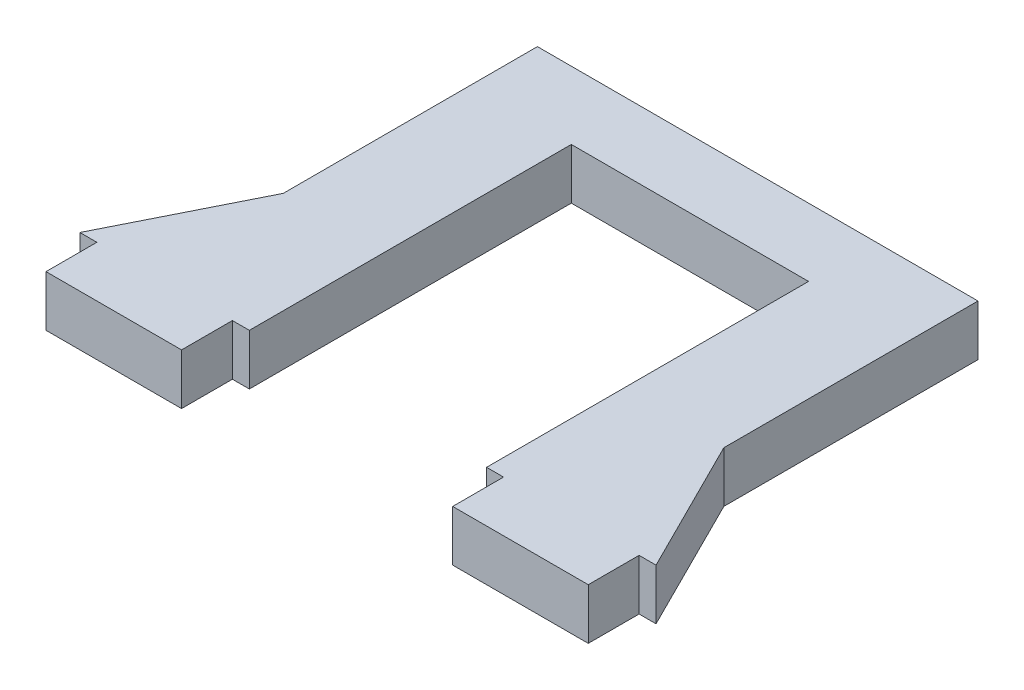
ISO-10303-21;
HEADER;
FILE_DESCRIPTION(('STEP AP214'),'2;1');
FILE_NAME('part.step','',(''),(''),'','','');
FILE_SCHEMA(('AUTOMOTIVE_DESIGN { 1 0 10303 214 1 1 1 1 }'));
ENDSEC;
DATA;
#1=APPLICATION_CONTEXT('core data for automotive mechanical design processes');
#2=APPLICATION_PROTOCOL_DEFINITION('international standard','automotive_design',2000,#1);
#3=PRODUCT_CONTEXT('',#1,'mechanical');
#4=PRODUCT('Part','Part','',(#3));
#5=PRODUCT_RELATED_PRODUCT_CATEGORY('part','',(#4));
#6=PRODUCT_DEFINITION_FORMATION('','',#4);
#7=PRODUCT_DEFINITION_CONTEXT('part definition',#1,'design');
#8=PRODUCT_DEFINITION('design','',#6,#7);
#9=PRODUCT_DEFINITION_SHAPE('','',#8);
#10=(LENGTH_UNIT() NAMED_UNIT(*) SI_UNIT(.MILLI.,.METRE.));
#11=(NAMED_UNIT(*) PLANE_ANGLE_UNIT() SI_UNIT($,.RADIAN.));
#12=(NAMED_UNIT(*) SI_UNIT($,.STERADIAN.) SOLID_ANGLE_UNIT());
#13=UNCERTAINTY_MEASURE_WITH_UNIT(LENGTH_MEASURE(1.E-05),#10,'distance_accuracy_value','');
#14=(GEOMETRIC_REPRESENTATION_CONTEXT(3) GLOBAL_UNCERTAINTY_ASSIGNED_CONTEXT((#13)) GLOBAL_UNIT_ASSIGNED_CONTEXT((#10,
#11,#12)) REPRESENTATION_CONTEXT('',''));
#15=CARTESIAN_POINT('',(0.,0.,0.));
#16=DIRECTION('',(0.,0.,1.));
#17=DIRECTION('',(1.,0.,0.));
#18=AXIS2_PLACEMENT_3D('',#15,#16,#17);
#19=CARTESIAN_POINT('',(7.,1.5,9.5));
#20=DIRECTION('',(0.,0.,-1.));
#21=DIRECTION('',(-1.,0.,0.));
#22=AXIS2_PLACEMENT_3D('',#19,#20,#21);
#23=PLANE('',#22);
#24=DIRECTION('',(0.,-1.,0.));
#25=VECTOR('',#24,1.);
#26=CARTESIAN_POINT('',(8.,1.5,9.5));
#27=LINE('',#26,#25);
#28=CARTESIAN_POINT('',(8.,1.5,9.5));
#29=VERTEX_POINT('',#28);
#30=CARTESIAN_POINT('',(8.,-1.5,9.5));
#31=VERTEX_POINT('',#30);
#32=EDGE_CURVE('E58',#29,#31,#27,.T.);
#33=ORIENTED_EDGE('',*,*,#32,.F.);
#34=DIRECTION('',(1.,0.,0.));
#35=VECTOR('',#34,1.);
#36=CARTESIAN_POINT('',(7.,1.5,9.5));
#37=LINE('',#36,#35);
#38=CARTESIAN_POINT('',(7.,1.5,9.5));
#39=VERTEX_POINT('',#38);
#40=EDGE_CURVE('E168',#39,#29,#37,.T.);
#41=ORIENTED_EDGE('',*,*,#40,.F.);
#42=DIRECTION('',(0.,-1.,0.));
#43=VECTOR('',#42,1.);
#44=CARTESIAN_POINT('',(7.,1.5,9.5));
#45=LINE('',#44,#43);
#46=CARTESIAN_POINT('',(7.,-1.5,9.5));
#47=VERTEX_POINT('',#46);
#48=EDGE_CURVE('E293',#39,#47,#45,.T.);
#49=ORIENTED_EDGE('',*,*,#48,.T.);
#50=DIRECTION('',(1.,0.,0.));
#51=VECTOR('',#50,1.);
#52=CARTESIAN_POINT('',(7.,-1.5,9.5));
#53=LINE('',#52,#51);
#54=EDGE_CURVE('E275',#47,#31,#53,.T.);
#55=ORIENTED_EDGE('',*,*,#54,.T.);
#56=EDGE_LOOP('',(#33,#41,#49,#55));
#57=FACE_BOUND('',#56,.T.);
#58=ADVANCED_FACE('F35',(#57),#23,.F.);
#59=DIRECTION('',(0.,-1.,0.));
#60=VECTOR('',#59,1.);
#61=CARTESIAN_POINT('',(16.,1.5,9.5));
#62=LINE('',#61,#60);
#63=CARTESIAN_POINT('',(16.,1.5,9.5));
#64=VERTEX_POINT('',#63);
#65=CARTESIAN_POINT('',(16.,-1.5,9.5));
#66=VERTEX_POINT('',#65);
#67=EDGE_CURVE('E186',#64,#66,#62,.T.);
#68=ORIENTED_EDGE('',*,*,#67,.T.);
#69=CARTESIAN_POINT('',(17.,-1.5,9.5));
#70=VERTEX_POINT('',#69);
#71=EDGE_CURVE('E274',#66,#70,#53,.T.);
#72=ORIENTED_EDGE('',*,*,#71,.T.);
#73=DIRECTION('',(0.,-1.,0.));
#74=VECTOR('',#73,1.);
#75=CARTESIAN_POINT('',(17.,1.5,9.5));
#76=LINE('',#75,#74);
#77=CARTESIAN_POINT('',(17.,1.5,9.5));
#78=VERTEX_POINT('',#77);
#79=EDGE_CURVE('E232',#78,#70,#76,.T.);
#80=ORIENTED_EDGE('',*,*,#79,.F.);
#81=EDGE_CURVE('E50',#64,#78,#37,.T.);
#82=ORIENTED_EDGE('',*,*,#81,.F.);
#83=EDGE_LOOP('',(#68,#72,#80,#82));
#84=FACE_BOUND('',#83,.T.);
#85=ADVANCED_FACE('F308',(#84),#23,.F.);
#86=CARTESIAN_POINT('',(-13.,1.5,9.5));
#87=DIRECTION('',(0.,0.,-1.));
#88=DIRECTION('',(-1.,0.,0.));
#89=AXIS2_PLACEMENT_3D('',#86,#87,#88);
#90=PLANE('',#89);
#91=DIRECTION('',(0.,-1.,0.));
#92=VECTOR('',#91,1.);
#93=CARTESIAN_POINT('',(-16.,1.5,9.5));
#94=LINE('',#93,#92);
#95=CARTESIAN_POINT('',(-16.,1.5,9.5));
#96=VERTEX_POINT('',#95);
#97=CARTESIAN_POINT('',(-16.,-1.5,9.5));
#98=VERTEX_POINT('',#97);
#99=EDGE_CURVE('E207',#96,#98,#94,.T.);
#100=ORIENTED_EDGE('',*,*,#99,.F.);
#101=DIRECTION('',(1.,0.,0.));
#102=VECTOR('',#101,1.);
#103=CARTESIAN_POINT('',(-13.,1.5,9.5));
#104=LINE('',#103,#102);
#105=CARTESIAN_POINT('',(-17.,1.5,9.5));
#106=VERTEX_POINT('',#105);
#107=EDGE_CURVE('E264',#106,#96,#104,.T.);
#108=ORIENTED_EDGE('',*,*,#107,.F.);
#109=DIRECTION('',(0.,-1.,0.));
#110=VECTOR('',#109,1.);
#111=CARTESIAN_POINT('',(-17.,1.5,9.5));
#112=LINE('',#111,#110);
#113=CARTESIAN_POINT('',(-17.,-1.5,9.5));
#114=VERTEX_POINT('',#113);
#115=EDGE_CURVE('E239',#106,#114,#112,.T.);
#116=ORIENTED_EDGE('',*,*,#115,.T.);
#117=DIRECTION('',(1.,0.,0.));
#118=VECTOR('',#117,1.);
#119=CARTESIAN_POINT('',(-13.,-1.5,9.5));
#120=LINE('',#119,#118);
#121=EDGE_CURVE('E251',#114,#98,#120,.T.);
#122=ORIENTED_EDGE('',*,*,#121,.T.);
#123=EDGE_LOOP('',(#100,#108,#116,#122));
#124=FACE_BOUND('',#123,.T.);
#125=ADVANCED_FACE('F313',(#124),#90,.F.);
#126=DIRECTION('',(0.,-1.,0.));
#127=VECTOR('',#126,1.);
#128=CARTESIAN_POINT('',(-8.,1.5,9.5));
#129=LINE('',#128,#127);
#130=CARTESIAN_POINT('',(-8.,1.5,9.5));
#131=VERTEX_POINT('',#130);
#132=CARTESIAN_POINT('',(-8.,-1.5,9.5));
#133=VERTEX_POINT('',#132);
#134=EDGE_CURVE('E216',#131,#133,#129,.T.);
#135=ORIENTED_EDGE('',*,*,#134,.T.);
#136=CARTESIAN_POINT('',(-7.,-1.5,9.5));
#137=VERTEX_POINT('',#136);
#138=EDGE_CURVE('E283',#133,#137,#120,.T.);
#139=ORIENTED_EDGE('',*,*,#138,.T.);
#140=DIRECTION('',(0.,-1.,0.));
#141=VECTOR('',#140,1.);
#142=CARTESIAN_POINT('',(-7.,1.5,9.5));
#143=LINE('',#142,#141);
#144=CARTESIAN_POINT('',(-7.,1.5,9.5));
#145=VERTEX_POINT('',#144);
#146=EDGE_CURVE('E267',#145,#137,#143,.T.);
#147=ORIENTED_EDGE('',*,*,#146,.F.);
#148=EDGE_CURVE('E263',#131,#145,#104,.T.);
#149=ORIENTED_EDGE('',*,*,#148,.F.);
#150=EDGE_LOOP('',(#135,#139,#147,#149));
#151=FACE_BOUND('',#150,.T.);
#152=ADVANCED_FACE('F332',(#151),#90,.F.);
#153=CARTESIAN_POINT('',(-13.,1.5,9.5));
#154=DIRECTION('',(1.,0.,0.));
#155=DIRECTION('',(0.,0.,-1.));
#156=AXIS2_PLACEMENT_3D('',#153,#154,#155);
#157=PLANE('',#156);
#158=DIRECTION('',(0.,-1.,0.));
#159=VECTOR('',#158,1.);
#160=CARTESIAN_POINT('',(-13.,1.5,1.5));
#161=LINE('',#160,#159);
#162=CARTESIAN_POINT('',(-13.,1.5,1.5));
#163=VERTEX_POINT('',#162);
#164=CARTESIAN_POINT('',(-13.,-1.5,1.5));
#165=VERTEX_POINT('',#164);
#166=EDGE_CURVE('E244',#163,#165,#161,.T.);
#167=ORIENTED_EDGE('',*,*,#166,.F.);
#168=DIRECTION('',(0.,0.,1.));
#169=VECTOR('',#168,1.);
#170=CARTESIAN_POINT('',(-13.,1.5,9.5));
#171=LINE('',#170,#169);
#172=CARTESIAN_POINT('',(-13.,1.5,-13.5));
#173=VERTEX_POINT('',#172);
#174=EDGE_CURVE('E260',#173,#163,#171,.T.);
#175=ORIENTED_EDGE('',*,*,#174,.F.);
#176=DIRECTION('',(0.,-1.,0.));
#177=VECTOR('',#176,1.);
#178=CARTESIAN_POINT('',(-13.,1.5,-13.5));
#179=LINE('',#178,#177);
#180=CARTESIAN_POINT('',(-13.,-1.5,-13.5));
#181=VERTEX_POINT('',#180);
#182=EDGE_CURVE('E287',#173,#181,#179,.T.);
#183=ORIENTED_EDGE('',*,*,#182,.T.);
#184=DIRECTION('',(0.,0.,1.));
#185=VECTOR('',#184,1.);
#186=CARTESIAN_POINT('',(-13.,-1.5,9.5));
#187=LINE('',#186,#185);
#188=EDGE_CURVE('E281',#181,#165,#187,.T.);
#189=ORIENTED_EDGE('',*,*,#188,.T.);
#190=EDGE_LOOP('',(#167,#175,#183,#189));
#191=FACE_BOUND('',#190,.T.);
#192=ADVANCED_FACE('F324',(#191),#157,.F.);
#193=CARTESIAN_POINT('',(-7.,1.5,-9.5));
#194=DIRECTION('',(-1.,0.,0.));
#195=DIRECTION('',(0.,0.,1.));
#196=AXIS2_PLACEMENT_3D('',#193,#194,#195);
#197=PLANE('',#196);
#198=DIRECTION('',(0.,0.,-1.));
#199=VECTOR('',#198,1.);
#200=CARTESIAN_POINT('',(-7.,-1.5,-9.5));
#201=LINE('',#200,#199);
#202=CARTESIAN_POINT('',(-7.,-1.5,-9.5));
#203=VERTEX_POINT('',#202);
#204=EDGE_CURVE('E247',#137,#203,#201,.T.);
#205=ORIENTED_EDGE('',*,*,#204,.T.);
#206=DIRECTION('',(0.,-1.,0.));
#207=VECTOR('',#206,1.);
#208=CARTESIAN_POINT('',(-7.,1.5,-9.5));
#209=LINE('',#208,#207);
#210=CARTESIAN_POINT('',(-7.,1.5,-9.5));
#211=VERTEX_POINT('',#210);
#212=EDGE_CURVE('E11',#211,#203,#209,.T.);
#213=ORIENTED_EDGE('',*,*,#212,.F.);
#214=DIRECTION('',(0.,0.,-1.));
#215=VECTOR('',#214,1.);
#216=CARTESIAN_POINT('',(-7.,1.5,-9.5));
#217=LINE('',#216,#215);
#218=EDGE_CURVE('E248',#145,#211,#217,.T.);
#219=ORIENTED_EDGE('',*,*,#218,.F.);
#220=ORIENTED_EDGE('',*,*,#146,.T.);
#221=EDGE_LOOP('',(#205,#213,#219,#220));
#222=FACE_BOUND('',#221,.T.);
#223=ADVANCED_FACE('F37',(#222),#197,.F.);
#224=CARTESIAN_POINT('',(-7.,1.5,-9.5));
#225=DIRECTION('',(0.,0.,-1.));
#226=DIRECTION('',(-1.,0.,0.));
#227=AXIS2_PLACEMENT_3D('',#224,#225,#226);
#228=PLANE('',#227);
#229=DIRECTION('',(1.,0.,0.));
#230=VECTOR('',#229,1.);
#231=CARTESIAN_POINT('',(-7.,-1.5,-9.5));
#232=LINE('',#231,#230);
#233=CARTESIAN_POINT('',(7.,-1.5,-9.5));
#234=VERTEX_POINT('',#233);
#235=EDGE_CURVE('E270',#203,#234,#232,.T.);
#236=ORIENTED_EDGE('',*,*,#235,.T.);
#237=DIRECTION('',(0.,-1.,0.));
#238=VECTOR('',#237,1.);
#239=CARTESIAN_POINT('',(7.,1.5,-9.5));
#240=LINE('',#239,#238);
#241=CARTESIAN_POINT('',(7.,1.5,-9.5));
#242=VERTEX_POINT('',#241);
#243=EDGE_CURVE('E43',#242,#234,#240,.T.);
#244=ORIENTED_EDGE('',*,*,#243,.F.);
#245=DIRECTION('',(1.,0.,0.));
#246=VECTOR('',#245,1.);
#247=CARTESIAN_POINT('',(-7.,1.5,-9.5));
#248=LINE('',#247,#246);
#249=EDGE_CURVE('E250',#211,#242,#248,.T.);
#250=ORIENTED_EDGE('',*,*,#249,.F.);
#251=ORIENTED_EDGE('',*,*,#212,.T.);
#252=EDGE_LOOP('',(#236,#244,#250,#251));
#253=FACE_BOUND('',#252,.T.);
#254=ADVANCED_FACE('F319',(#253),#228,.F.);
#255=CARTESIAN_POINT('',(7.,1.5,-9.5));
#256=DIRECTION('',(1.,0.,0.));
#257=DIRECTION('',(0.,0.,-1.));
#258=AXIS2_PLACEMENT_3D('',#255,#256,#257);
#259=PLANE('',#258);
#260=DIRECTION('',(0.,0.,1.));
#261=VECTOR('',#260,1.);
#262=CARTESIAN_POINT('',(7.,-1.5,-9.5));
#263=LINE('',#262,#261);
#264=EDGE_CURVE('E272',#234,#47,#263,.T.);
#265=ORIENTED_EDGE('',*,*,#264,.T.);
#266=ORIENTED_EDGE('',*,*,#48,.F.);
#267=DIRECTION('',(0.,0.,1.));
#268=VECTOR('',#267,1.);
#269=CARTESIAN_POINT('',(7.,1.5,-9.5));
#270=LINE('',#269,#268);
#271=EDGE_CURVE('E253',#242,#39,#270,.T.);
#272=ORIENTED_EDGE('',*,*,#271,.F.);
#273=ORIENTED_EDGE('',*,*,#243,.T.);
#274=EDGE_LOOP('',(#265,#266,#272,#273));
#275=FACE_BOUND('',#274,.T.);
#276=ADVANCED_FACE('F300',(#275),#259,.F.);
#277=CARTESIAN_POINT('',(13.,1.5,9.5));
#278=DIRECTION('',(-1.,0.,0.));
#279=DIRECTION('',(0.,0.,1.));
#280=AXIS2_PLACEMENT_3D('',#277,#278,#279);
#281=PLANE('',#280);
#282=DIRECTION('',(0.,0.,-1.));
#283=VECTOR('',#282,1.);
#284=CARTESIAN_POINT('',(13.,1.5,9.5));
#285=LINE('',#284,#283);
#286=CARTESIAN_POINT('',(13.,1.5,1.5));
#287=VERTEX_POINT('',#286);
#288=CARTESIAN_POINT('',(13.,1.5,-13.5));
#289=VERTEX_POINT('',#288);
#290=EDGE_CURVE('E256',#287,#289,#285,.T.);
#291=ORIENTED_EDGE('',*,*,#290,.F.);
#292=DIRECTION('',(0.,-1.,0.));
#293=VECTOR('',#292,1.);
#294=CARTESIAN_POINT('',(13.,1.5,1.5));
#295=LINE('',#294,#293);
#296=CARTESIAN_POINT('',(13.,-1.5,1.5));
#297=VERTEX_POINT('',#296);
#298=EDGE_CURVE('E228',#287,#297,#295,.T.);
#299=ORIENTED_EDGE('',*,*,#298,.T.);
#300=DIRECTION('',(0.,0.,-1.));
#301=VECTOR('',#300,1.);
#302=CARTESIAN_POINT('',(13.,-1.5,9.5));
#303=LINE('',#302,#301);
#304=CARTESIAN_POINT('',(13.,-1.5,-13.5));
#305=VERTEX_POINT('',#304);
#306=EDGE_CURVE('E277',#297,#305,#303,.T.);
#307=ORIENTED_EDGE('',*,*,#306,.T.);
#308=DIRECTION('',(0.,-1.,0.));
#309=VECTOR('',#308,1.);
#310=CARTESIAN_POINT('',(13.,1.5,-13.5));
#311=LINE('',#310,#309);
#312=EDGE_CURVE('E290',#289,#305,#311,.T.);
#313=ORIENTED_EDGE('',*,*,#312,.F.);
#314=EDGE_LOOP('',(#291,#299,#307,#313));
#315=FACE_BOUND('',#314,.T.);
#316=ADVANCED_FACE('F316',(#315),#281,.F.);
#317=CARTESIAN_POINT('',(-13.,1.5,-13.5));
#318=DIRECTION('',(0.,0.,1.));
#319=DIRECTION('',(1.,0.,0.));
#320=AXIS2_PLACEMENT_3D('',#317,#318,#319);
#321=PLANE('',#320);
#322=DIRECTION('',(-1.,0.,0.));
#323=VECTOR('',#322,1.);
#324=CARTESIAN_POINT('',(-13.,-1.5,-13.5));
#325=LINE('',#324,#323);
#326=EDGE_CURVE('E279',#305,#181,#325,.T.);
#327=ORIENTED_EDGE('',*,*,#326,.T.);
#328=ORIENTED_EDGE('',*,*,#182,.F.);
#329=DIRECTION('',(-1.,0.,0.));
#330=VECTOR('',#329,1.);
#331=CARTESIAN_POINT('',(-13.,1.5,-13.5));
#332=LINE('',#331,#330);
#333=EDGE_CURVE('E258',#289,#173,#332,.T.);
#334=ORIENTED_EDGE('',*,*,#333,.F.);
#335=ORIENTED_EDGE('',*,*,#312,.T.);
#336=EDGE_LOOP('',(#327,#328,#334,#335));
#337=FACE_BOUND('',#336,.T.);
#338=ADVANCED_FACE('F358',(#337),#321,.F.);
#339=CARTESIAN_POINT('',(0.,1.5,0.));
#340=DIRECTION('',(0.,1.,0.));
#341=DIRECTION('',(0.,0.,1.));
#342=AXIS2_PLACEMENT_3D('',#339,#340,#341);
#343=PLANE('',#342);
#344=ORIENTED_EDGE('',*,*,#218,.T.);
#345=ORIENTED_EDGE('',*,*,#249,.T.);
#346=ORIENTED_EDGE('',*,*,#271,.T.);
#347=ORIENTED_EDGE('',*,*,#40,.T.);
#348=DIRECTION('',(0.,0.,1.));
#349=VECTOR('',#348,1.);
#350=CARTESIAN_POINT('',(8.,1.5,9.5));
#351=LINE('',#350,#349);
#352=CARTESIAN_POINT('',(8.,1.5,12.5));
#353=VERTEX_POINT('',#352);
#354=EDGE_CURVE('E161',#29,#353,#351,.T.);
#355=ORIENTED_EDGE('',*,*,#354,.T.);
#356=DIRECTION('',(1.,0.,0.));
#357=VECTOR('',#356,1.);
#358=CARTESIAN_POINT('',(16.,1.5,12.5));
#359=LINE('',#358,#357);
#360=CARTESIAN_POINT('',(16.,1.5,12.5));
#361=VERTEX_POINT('',#360);
#362=EDGE_CURVE('E166',#353,#361,#359,.T.);
#363=ORIENTED_EDGE('',*,*,#362,.T.);
#364=DIRECTION('',(0.,0.,-1.));
#365=VECTOR('',#364,1.);
#366=CARTESIAN_POINT('',(16.,1.5,9.5));
#367=LINE('',#366,#365);
#368=EDGE_CURVE('E184',#361,#64,#367,.T.);
#369=ORIENTED_EDGE('',*,*,#368,.T.);
#370=ORIENTED_EDGE('',*,*,#81,.T.);
#371=DIRECTION('',(-0.447213595499958,0.,-0.894427190999916));
#372=VECTOR('',#371,1.);
#373=CARTESIAN_POINT('',(13.,1.5,1.5));
#374=LINE('',#373,#372);
#375=EDGE_CURVE('E226',#78,#287,#374,.T.);
#376=ORIENTED_EDGE('',*,*,#375,.T.);
#377=ORIENTED_EDGE('',*,*,#290,.T.);
#378=ORIENTED_EDGE('',*,*,#333,.T.);
#379=ORIENTED_EDGE('',*,*,#174,.T.);
#380=DIRECTION('',(-0.447213595499958,0.,0.894427190999916));
#381=VECTOR('',#380,1.);
#382=CARTESIAN_POINT('',(-13.,1.5,1.5));
#383=LINE('',#382,#381);
#384=EDGE_CURVE('E236',#163,#106,#383,.T.);
#385=ORIENTED_EDGE('',*,*,#384,.T.);
#386=ORIENTED_EDGE('',*,*,#107,.T.);
#387=DIRECTION('',(0.,0.,1.));
#388=VECTOR('',#387,1.);
#389=CARTESIAN_POINT('',(-16.,1.5,9.5));
#390=LINE('',#389,#388);
#391=CARTESIAN_POINT('',(-16.,1.5,12.5));
#392=VERTEX_POINT('',#391);
#393=EDGE_CURVE('E198',#96,#392,#390,.T.);
#394=ORIENTED_EDGE('',*,*,#393,.T.);
#395=DIRECTION('',(1.,0.,0.));
#396=VECTOR('',#395,1.);
#397=CARTESIAN_POINT('',(-16.,1.5,12.5));
#398=LINE('',#397,#396);
#399=CARTESIAN_POINT('',(-8.,1.5,12.5));
#400=VERTEX_POINT('',#399);
#401=EDGE_CURVE('E201',#392,#400,#398,.T.);
#402=ORIENTED_EDGE('',*,*,#401,.T.);
#403=DIRECTION('',(0.,0.,-1.));
#404=VECTOR('',#403,1.);
#405=CARTESIAN_POINT('',(-8.,1.5,9.5));
#406=LINE('',#405,#404);
#407=EDGE_CURVE('E204',#400,#131,#406,.T.);
#408=ORIENTED_EDGE('',*,*,#407,.T.);
#409=ORIENTED_EDGE('',*,*,#148,.T.);
#410=EDGE_LOOP('',(#344,#345,#346,#347,#355,#363,#369,#370,#376,#377,#378,#379,#385,#386,#394,
#402,#408,#409));
#411=FACE_BOUND('',#410,.T.);
#412=ADVANCED_FACE('F164',(#411),#343,.T.);
#413=CARTESIAN_POINT('',(0.,-1.5,0.));
#414=DIRECTION('',(0.,1.,0.));
#415=DIRECTION('',(0.,0.,1.));
#416=AXIS2_PLACEMENT_3D('',#413,#414,#415);
#417=PLANE('',#416);
#418=ORIENTED_EDGE('',*,*,#204,.F.);
#419=ORIENTED_EDGE('',*,*,#138,.F.);
#420=DIRECTION('',(0.,0.,-1.));
#421=VECTOR('',#420,1.);
#422=CARTESIAN_POINT('',(-8.,-1.5,9.5));
#423=LINE('',#422,#421);
#424=CARTESIAN_POINT('',(-8.,-1.5,12.5));
#425=VERTEX_POINT('',#424);
#426=EDGE_CURVE('E202',#425,#133,#423,.T.);
#427=ORIENTED_EDGE('',*,*,#426,.F.);
#428=DIRECTION('',(1.,0.,0.));
#429=VECTOR('',#428,1.);
#430=CARTESIAN_POINT('',(-16.,-1.5,12.5));
#431=LINE('',#430,#429);
#432=CARTESIAN_POINT('',(-16.,-1.5,12.5));
#433=VERTEX_POINT('',#432);
#434=EDGE_CURVE('E210',#433,#425,#431,.T.);
#435=ORIENTED_EDGE('',*,*,#434,.F.);
#436=DIRECTION('',(0.,0.,1.));
#437=VECTOR('',#436,1.);
#438=CARTESIAN_POINT('',(-16.,-1.5,9.5));
#439=LINE('',#438,#437);
#440=EDGE_CURVE('E197',#98,#433,#439,.T.);
#441=ORIENTED_EDGE('',*,*,#440,.F.);
#442=ORIENTED_EDGE('',*,*,#121,.F.);
#443=DIRECTION('',(-0.447213595499958,0.,0.894427190999916));
#444=VECTOR('',#443,1.);
#445=CARTESIAN_POINT('',(-13.,-1.5,1.5));
#446=LINE('',#445,#444);
#447=EDGE_CURVE('E235',#165,#114,#446,.T.);
#448=ORIENTED_EDGE('',*,*,#447,.F.);
#449=ORIENTED_EDGE('',*,*,#188,.F.);
#450=ORIENTED_EDGE('',*,*,#326,.F.);
#451=ORIENTED_EDGE('',*,*,#306,.F.);
#452=DIRECTION('',(-0.447213595499958,0.,-0.894427190999916));
#453=VECTOR('',#452,1.);
#454=CARTESIAN_POINT('',(13.,-1.5,1.5));
#455=LINE('',#454,#453);
#456=EDGE_CURVE('E225',#70,#297,#455,.T.);
#457=ORIENTED_EDGE('',*,*,#456,.F.);
#458=ORIENTED_EDGE('',*,*,#71,.F.);
#459=DIRECTION('',(0.,0.,-1.));
#460=VECTOR('',#459,1.);
#461=CARTESIAN_POINT('',(16.,-1.5,9.5));
#462=LINE('',#461,#460);
#463=CARTESIAN_POINT('',(16.,-1.5,12.5));
#464=VERTEX_POINT('',#463);
#465=EDGE_CURVE('E170',#464,#66,#462,.T.);
#466=ORIENTED_EDGE('',*,*,#465,.F.);
#467=DIRECTION('',(1.,0.,0.));
#468=VECTOR('',#467,1.);
#469=CARTESIAN_POINT('',(16.,-1.5,12.5));
#470=LINE('',#469,#468);
#471=CARTESIAN_POINT('',(8.,-1.5,12.5));
#472=VERTEX_POINT('',#471);
#473=EDGE_CURVE('E190',#472,#464,#470,.T.);
#474=ORIENTED_EDGE('',*,*,#473,.F.);
#475=DIRECTION('',(0.,0.,1.));
#476=VECTOR('',#475,1.);
#477=CARTESIAN_POINT('',(8.,-1.5,9.5));
#478=LINE('',#477,#476);
#479=EDGE_CURVE('E176',#31,#472,#478,.T.);
#480=ORIENTED_EDGE('',*,*,#479,.F.);
#481=ORIENTED_EDGE('',*,*,#54,.F.);
#482=ORIENTED_EDGE('',*,*,#264,.F.);
#483=ORIENTED_EDGE('',*,*,#235,.F.);
#484=EDGE_LOOP('',(#418,#419,#427,#435,#441,#442,#448,#449,#450,#451,#457,#458,#466,#474,#480,
#481,#482,#483));
#485=FACE_BOUND('',#484,.T.);
#486=ADVANCED_FACE('F306',(#485),#417,.F.);
#487=CARTESIAN_POINT('',(-13.,1.5,1.5));
#488=DIRECTION('',(0.894427190999916,0.,0.447213595499958));
#489=DIRECTION('',(0.447213595499958,0.,-0.894427190999916));
#490=AXIS2_PLACEMENT_3D('',#487,#488,#489);
#491=PLANE('',#490);
#492=ORIENTED_EDGE('',*,*,#447,.T.);
#493=ORIENTED_EDGE('',*,*,#115,.F.);
#494=ORIENTED_EDGE('',*,*,#384,.F.);
#495=ORIENTED_EDGE('',*,*,#166,.T.);
#496=EDGE_LOOP('',(#492,#493,#494,#495));
#497=FACE_BOUND('',#496,.T.);
#498=ADVANCED_FACE('F350',(#497),#491,.F.);
#499=CARTESIAN_POINT('',(13.,1.5,1.5));
#500=DIRECTION('',(-0.894427190999916,0.,0.447213595499958));
#501=DIRECTION('',(0.447213595499958,0.,0.894427190999916));
#502=AXIS2_PLACEMENT_3D('',#499,#500,#501);
#503=PLANE('',#502);
#504=ORIENTED_EDGE('',*,*,#456,.T.);
#505=ORIENTED_EDGE('',*,*,#298,.F.);
#506=ORIENTED_EDGE('',*,*,#375,.F.);
#507=ORIENTED_EDGE('',*,*,#79,.T.);
#508=EDGE_LOOP('',(#504,#505,#506,#507));
#509=FACE_BOUND('',#508,.T.);
#510=ADVANCED_FACE('F367',(#509),#503,.F.);
#511=CARTESIAN_POINT('',(-16.,1.5,9.5));
#512=DIRECTION('',(1.,0.,0.));
#513=DIRECTION('',(0.,0.,-1.));
#514=AXIS2_PLACEMENT_3D('',#511,#512,#513);
#515=PLANE('',#514);
#516=ORIENTED_EDGE('',*,*,#440,.T.);
#517=DIRECTION('',(0.,-1.,0.));
#518=VECTOR('',#517,1.);
#519=CARTESIAN_POINT('',(-16.,1.5,12.5));
#520=LINE('',#519,#518);
#521=EDGE_CURVE('E222',#392,#433,#520,.T.);
#522=ORIENTED_EDGE('',*,*,#521,.F.);
#523=ORIENTED_EDGE('',*,*,#393,.F.);
#524=ORIENTED_EDGE('',*,*,#99,.T.);
#525=EDGE_LOOP('',(#516,#522,#523,#524));
#526=FACE_BOUND('',#525,.T.);
#527=ADVANCED_FACE('F343',(#526),#515,.F.);
#528=CARTESIAN_POINT('',(-16.,1.5,12.5));
#529=DIRECTION('',(0.,0.,-1.));
#530=DIRECTION('',(-1.,0.,0.));
#531=AXIS2_PLACEMENT_3D('',#528,#529,#530);
#532=PLANE('',#531);
#533=ORIENTED_EDGE('',*,*,#434,.T.);
#534=DIRECTION('',(0.,-1.,0.));
#535=VECTOR('',#534,1.);
#536=CARTESIAN_POINT('',(-8.,1.5,12.5));
#537=LINE('',#536,#535);
#538=EDGE_CURVE('E219',#400,#425,#537,.T.);
#539=ORIENTED_EDGE('',*,*,#538,.F.);
#540=ORIENTED_EDGE('',*,*,#401,.F.);
#541=ORIENTED_EDGE('',*,*,#521,.T.);
#542=EDGE_LOOP('',(#533,#539,#540,#541));
#543=FACE_BOUND('',#542,.T.);
#544=ADVANCED_FACE('F338',(#543),#532,.F.);
#545=CARTESIAN_POINT('',(-8.,1.5,9.5));
#546=DIRECTION('',(-1.,0.,0.));
#547=DIRECTION('',(0.,0.,1.));
#548=AXIS2_PLACEMENT_3D('',#545,#546,#547);
#549=PLANE('',#548);
#550=ORIENTED_EDGE('',*,*,#426,.T.);
#551=ORIENTED_EDGE('',*,*,#134,.F.);
#552=ORIENTED_EDGE('',*,*,#407,.F.);
#553=ORIENTED_EDGE('',*,*,#538,.T.);
#554=EDGE_LOOP('',(#550,#551,#552,#553));
#555=FACE_BOUND('',#554,.T.);
#556=ADVANCED_FACE('F335',(#555),#549,.F.);
#557=CARTESIAN_POINT('',(8.,1.5,9.5));
#558=DIRECTION('',(1.,0.,0.));
#559=DIRECTION('',(0.,0.,-1.));
#560=AXIS2_PLACEMENT_3D('',#557,#558,#559);
#561=PLANE('',#560);
#562=ORIENTED_EDGE('',*,*,#479,.T.);
#563=DIRECTION('',(0.,-1.,0.));
#564=VECTOR('',#563,1.);
#565=CARTESIAN_POINT('',(8.,1.5,12.5));
#566=LINE('',#565,#564);
#567=EDGE_CURVE('E173',#353,#472,#566,.T.);
#568=ORIENTED_EDGE('',*,*,#567,.F.);
#569=ORIENTED_EDGE('',*,*,#354,.F.);
#570=ORIENTED_EDGE('',*,*,#32,.T.);
#571=EDGE_LOOP('',(#562,#568,#569,#570));
#572=FACE_BOUND('',#571,.T.);
#573=ADVANCED_FACE('F174',(#572),#561,.F.);
#574=CARTESIAN_POINT('',(16.,1.5,12.5));
#575=DIRECTION('',(0.,0.,-1.));
#576=DIRECTION('',(-1.,0.,0.));
#577=AXIS2_PLACEMENT_3D('',#574,#575,#576);
#578=PLANE('',#577);
#579=ORIENTED_EDGE('',*,*,#473,.T.);
#580=DIRECTION('',(0.,-1.,0.));
#581=VECTOR('',#580,1.);
#582=CARTESIAN_POINT('',(16.,1.5,12.5));
#583=LINE('',#582,#581);
#584=EDGE_CURVE('E179',#361,#464,#583,.T.);
#585=ORIENTED_EDGE('',*,*,#584,.F.);
#586=ORIENTED_EDGE('',*,*,#362,.F.);
#587=ORIENTED_EDGE('',*,*,#567,.T.);
#588=EDGE_LOOP('',(#579,#585,#586,#587));
#589=FACE_BOUND('',#588,.T.);
#590=ADVANCED_FACE('F181',(#589),#578,.F.);
#591=CARTESIAN_POINT('',(16.,1.5,9.5));
#592=DIRECTION('',(-1.,0.,0.));
#593=DIRECTION('',(0.,0.,1.));
#594=AXIS2_PLACEMENT_3D('',#591,#592,#593);
#595=PLANE('',#594);
#596=ORIENTED_EDGE('',*,*,#465,.T.);
#597=ORIENTED_EDGE('',*,*,#67,.F.);
#598=ORIENTED_EDGE('',*,*,#368,.F.);
#599=ORIENTED_EDGE('',*,*,#584,.T.);
#600=EDGE_LOOP('',(#596,#597,#598,#599));
#601=FACE_BOUND('',#600,.T.);
#602=ADVANCED_FACE('F370',(#601),#595,.F.);
#603=CLOSED_SHELL('',(#58,#85,#125,#152,#192,#223,#254,#276,#316,#338,#412,#486,#498,#510,#527,
#544,#556,#573,#590,#602));
#604=MANIFOLD_SOLID_BREP('B2',#603);
#605=ADVANCED_BREP_SHAPE_REPRESENTATION('',(#18,#604),#14);
#606=SHAPE_DEFINITION_REPRESENTATION(#9,#605);
ENDSEC;
END-ISO-10303-21;
